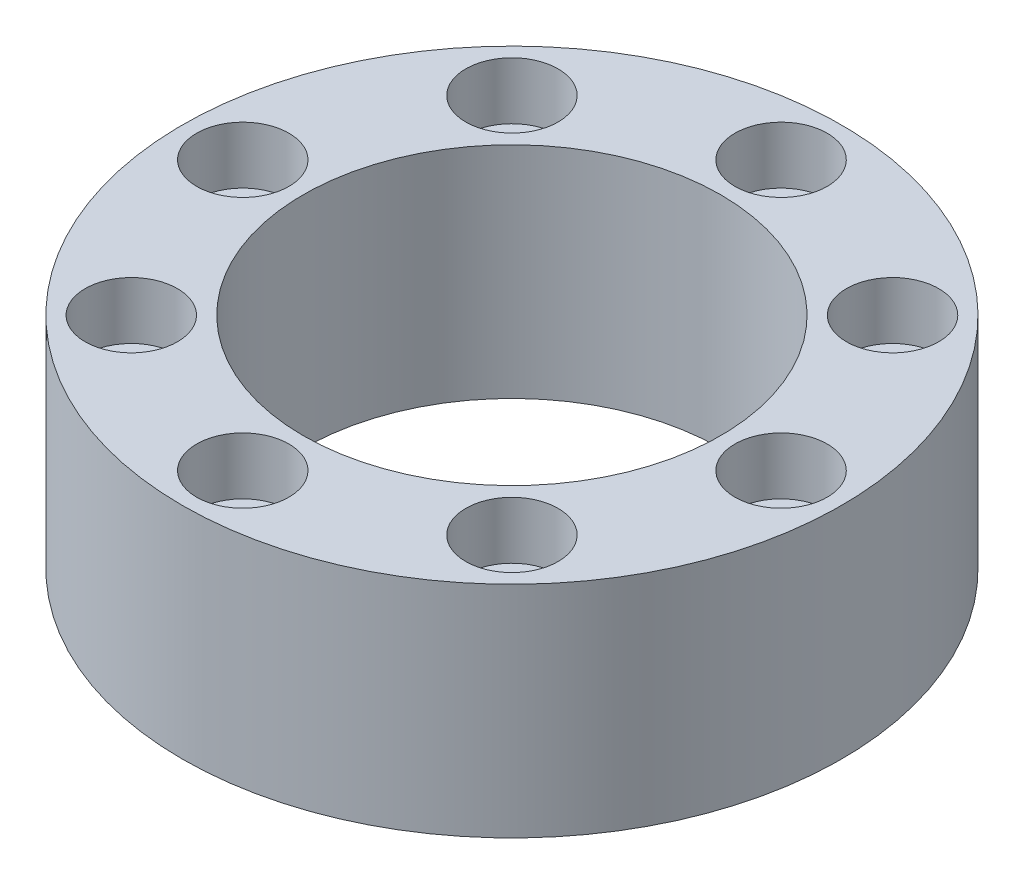
ISO-10303-21;
HEADER;
FILE_DESCRIPTION(('STEP AP214'),'2;1');
FILE_NAME('part.step','',(''),(''),'','','');
FILE_SCHEMA(('AUTOMOTIVE_DESIGN { 1 0 10303 214 1 1 1 1 }'));
ENDSEC;
DATA;
#1=APPLICATION_CONTEXT('core data for automotive mechanical design processes');
#2=APPLICATION_PROTOCOL_DEFINITION('international standard','automotive_design',2000,#1);
#3=PRODUCT_CONTEXT('',#1,'mechanical');
#4=PRODUCT('Part','Part','',(#3));
#5=PRODUCT_RELATED_PRODUCT_CATEGORY('part','',(#4));
#6=PRODUCT_DEFINITION_FORMATION('','',#4);
#7=PRODUCT_DEFINITION_CONTEXT('part definition',#1,'design');
#8=PRODUCT_DEFINITION('design','',#6,#7);
#9=PRODUCT_DEFINITION_SHAPE('','',#8);
#10=(LENGTH_UNIT() NAMED_UNIT(*) SI_UNIT(.MILLI.,.METRE.));
#11=(NAMED_UNIT(*) PLANE_ANGLE_UNIT() SI_UNIT($,.RADIAN.));
#12=(NAMED_UNIT(*) SI_UNIT($,.STERADIAN.) SOLID_ANGLE_UNIT());
#13=UNCERTAINTY_MEASURE_WITH_UNIT(LENGTH_MEASURE(1.E-05),#10,'distance_accuracy_value','');
#14=(GEOMETRIC_REPRESENTATION_CONTEXT(3) GLOBAL_UNCERTAINTY_ASSIGNED_CONTEXT((#13)) GLOBAL_UNIT_ASSIGNED_CONTEXT((#10,
#11,#12)) REPRESENTATION_CONTEXT('',''));
#15=CARTESIAN_POINT('',(0.,0.,0.));
#16=DIRECTION('',(0.,0.,1.));
#17=DIRECTION('',(1.,0.,0.));
#18=AXIS2_PLACEMENT_3D('',#15,#16,#17);
#19=CARTESIAN_POINT('',(17.3241161390704,0.,-17.3241161390704));
#20=DIRECTION('',(0.,1.,0.));
#21=DIRECTION('',(0.,0.,1.));
#22=AXIS2_PLACEMENT_3D('',#19,#20,#21);
#23=CYLINDRICAL_SURFACE('',#22,2.55);
#24=CARTESIAN_POINT('',(17.3241161390704,0.,-17.3241161390704));
#25=DIRECTION('',(0.,1.,0.));
#26=DIRECTION('',(0.,0.,1.));
#27=AXIS2_PLACEMENT_3D('',#24,#25,#26);
#28=CIRCLE('',#27,2.55);
#29=CARTESIAN_POINT('',(17.3241161390704,0.,-14.7741161390704));
#30=VERTEX_POINT('',#29);
#31=EDGE_CURVE('E215',#30,#30,#28,.T.);
#32=ORIENTED_EDGE('',*,*,#31,.F.);
#33=EDGE_LOOP('',(#32));
#34=FACE_BOUND('',#33,.T.);
#35=CARTESIAN_POINT('',(17.3241161390704,14.8,-17.3241161390704));
#36=DIRECTION('',(0.,1.,0.));
#37=DIRECTION('',(0.,0.,1.));
#38=AXIS2_PLACEMENT_3D('',#35,#36,#37);
#39=CIRCLE('',#38,2.55);
#40=CARTESIAN_POINT('',(17.3241161390704,14.8,-14.7741161390704));
#41=VERTEX_POINT('',#40);
#42=EDGE_CURVE('E47',#41,#41,#39,.F.);
#43=ORIENTED_EDGE('',*,*,#42,.F.);
#44=EDGE_LOOP('',(#43));
#45=FACE_BOUND('',#44,.T.);
#46=ADVANCED_FACE('F43',(#34,#45),#23,.F.);
#47=CARTESIAN_POINT('',(0.,0.,-24.5));
#48=DIRECTION('',(0.,1.,0.));
#49=DIRECTION('',(0.,0.,1.));
#50=AXIS2_PLACEMENT_3D('',#47,#48,#49);
#51=CYLINDRICAL_SURFACE('',#50,2.55);
#52=CARTESIAN_POINT('',(0.,0.,-24.5));
#53=DIRECTION('',(0.,1.,0.));
#54=DIRECTION('',(0.,0.,1.));
#55=AXIS2_PLACEMENT_3D('',#52,#53,#54);
#56=CIRCLE('',#55,2.55);
#57=CARTESIAN_POINT('',(0.,0.,-21.95));
#58=VERTEX_POINT('',#57);
#59=EDGE_CURVE('E225',#58,#58,#56,.T.);
#60=ORIENTED_EDGE('',*,*,#59,.F.);
#61=EDGE_LOOP('',(#60));
#62=FACE_BOUND('',#61,.T.);
#63=CARTESIAN_POINT('',(0.,14.8,-24.5));
#64=DIRECTION('',(0.,1.,0.));
#65=DIRECTION('',(0.,0.,1.));
#66=AXIS2_PLACEMENT_3D('',#63,#64,#65);
#67=CIRCLE('',#66,2.55);
#68=CARTESIAN_POINT('',(0.,14.8,-21.95));
#69=VERTEX_POINT('',#68);
#70=EDGE_CURVE('E387',#69,#69,#67,.F.);
#71=ORIENTED_EDGE('',*,*,#70,.F.);
#72=EDGE_LOOP('',(#71));
#73=FACE_BOUND('',#72,.T.);
#74=ADVANCED_FACE('F286',(#62,#73),#51,.F.);
#75=CARTESIAN_POINT('',(-17.3241161390704,0.,-17.3241161390704));
#76=DIRECTION('',(0.,1.,0.));
#77=DIRECTION('',(0.,0.,1.));
#78=AXIS2_PLACEMENT_3D('',#75,#76,#77);
#79=CYLINDRICAL_SURFACE('',#78,2.55);
#80=CARTESIAN_POINT('',(-17.3241161390704,0.,-17.3241161390704));
#81=DIRECTION('',(0.,1.,0.));
#82=DIRECTION('',(0.,0.,1.));
#83=AXIS2_PLACEMENT_3D('',#80,#81,#82);
#84=CIRCLE('',#83,2.55);
#85=CARTESIAN_POINT('',(-17.3241161390704,0.,-14.7741161390704));
#86=VERTEX_POINT('',#85);
#87=EDGE_CURVE('E230',#86,#86,#84,.T.);
#88=ORIENTED_EDGE('',*,*,#87,.F.);
#89=EDGE_LOOP('',(#88));
#90=FACE_BOUND('',#89,.T.);
#91=CARTESIAN_POINT('',(-17.3241161390704,14.8,-17.3241161390704));
#92=DIRECTION('',(0.,1.,0.));
#93=DIRECTION('',(0.,0.,1.));
#94=AXIS2_PLACEMENT_3D('',#91,#92,#93);
#95=CIRCLE('',#94,2.55);
#96=CARTESIAN_POINT('',(-17.3241161390704,14.8,-14.7741161390704));
#97=VERTEX_POINT('',#96);
#98=EDGE_CURVE('E393',#97,#97,#95,.F.);
#99=ORIENTED_EDGE('',*,*,#98,.F.);
#100=EDGE_LOOP('',(#99));
#101=FACE_BOUND('',#100,.T.);
#102=ADVANCED_FACE('F291',(#90,#101),#79,.F.);
#103=CARTESIAN_POINT('',(-24.5,0.,0.));
#104=DIRECTION('',(0.,1.,0.));
#105=DIRECTION('',(0.,0.,1.));
#106=AXIS2_PLACEMENT_3D('',#103,#104,#105);
#107=CYLINDRICAL_SURFACE('',#106,2.55);
#108=CARTESIAN_POINT('',(-24.5,0.,0.));
#109=DIRECTION('',(0.,1.,0.));
#110=DIRECTION('',(0.,0.,1.));
#111=AXIS2_PLACEMENT_3D('',#108,#109,#110);
#112=CIRCLE('',#111,2.55);
#113=CARTESIAN_POINT('',(-24.5,0.,2.55));
#114=VERTEX_POINT('',#113);
#115=EDGE_CURVE('E235',#114,#114,#112,.T.);
#116=ORIENTED_EDGE('',*,*,#115,.F.);
#117=EDGE_LOOP('',(#116));
#118=FACE_BOUND('',#117,.T.);
#119=CARTESIAN_POINT('',(-24.5,14.8,0.));
#120=DIRECTION('',(0.,1.,0.));
#121=DIRECTION('',(0.,0.,1.));
#122=AXIS2_PLACEMENT_3D('',#119,#120,#121);
#123=CIRCLE('',#122,2.55);
#124=CARTESIAN_POINT('',(-24.5,14.8,2.55));
#125=VERTEX_POINT('',#124);
#126=EDGE_CURVE('E399',#125,#125,#123,.F.);
#127=ORIENTED_EDGE('',*,*,#126,.F.);
#128=EDGE_LOOP('',(#127));
#129=FACE_BOUND('',#128,.T.);
#130=ADVANCED_FACE('F299',(#118,#129),#107,.F.);
#131=CARTESIAN_POINT('',(-17.3241161390704,0.,17.3241161390704));
#132=DIRECTION('',(0.,1.,0.));
#133=DIRECTION('',(0.,0.,1.));
#134=AXIS2_PLACEMENT_3D('',#131,#132,#133);
#135=CYLINDRICAL_SURFACE('',#134,2.55);
#136=CARTESIAN_POINT('',(-17.3241161390704,0.,17.3241161390704));
#137=DIRECTION('',(0.,1.,0.));
#138=DIRECTION('',(0.,0.,1.));
#139=AXIS2_PLACEMENT_3D('',#136,#137,#138);
#140=CIRCLE('',#139,2.55);
#141=CARTESIAN_POINT('',(-17.3241161390704,0.,19.8741161390704));
#142=VERTEX_POINT('',#141);
#143=EDGE_CURVE('E240',#142,#142,#140,.T.);
#144=ORIENTED_EDGE('',*,*,#143,.F.);
#145=EDGE_LOOP('',(#144));
#146=FACE_BOUND('',#145,.T.);
#147=CARTESIAN_POINT('',(-17.3241161390704,14.8,17.3241161390704));
#148=DIRECTION('',(0.,1.,0.));
#149=DIRECTION('',(0.,0.,1.));
#150=AXIS2_PLACEMENT_3D('',#147,#148,#149);
#151=CIRCLE('',#150,2.55);
#152=CARTESIAN_POINT('',(-17.3241161390704,14.8,19.8741161390704));
#153=VERTEX_POINT('',#152);
#154=EDGE_CURVE('E405',#153,#153,#151,.F.);
#155=ORIENTED_EDGE('',*,*,#154,.F.);
#156=EDGE_LOOP('',(#155));
#157=FACE_BOUND('',#156,.T.);
#158=ADVANCED_FACE('F303',(#146,#157),#135,.F.);
#159=CARTESIAN_POINT('',(0.,0.,24.5));
#160=DIRECTION('',(0.,1.,0.));
#161=DIRECTION('',(0.,0.,1.));
#162=AXIS2_PLACEMENT_3D('',#159,#160,#161);
#163=CYLINDRICAL_SURFACE('',#162,2.55);
#164=CARTESIAN_POINT('',(0.,0.,24.5));
#165=DIRECTION('',(0.,1.,0.));
#166=DIRECTION('',(0.,0.,1.));
#167=AXIS2_PLACEMENT_3D('',#164,#165,#166);
#168=CIRCLE('',#167,2.55);
#169=CARTESIAN_POINT('',(0.,0.,27.05));
#170=VERTEX_POINT('',#169);
#171=EDGE_CURVE('E245',#170,#170,#168,.T.);
#172=ORIENTED_EDGE('',*,*,#171,.F.);
#173=EDGE_LOOP('',(#172));
#174=FACE_BOUND('',#173,.T.);
#175=CARTESIAN_POINT('',(0.,14.8,24.5));
#176=DIRECTION('',(0.,1.,0.));
#177=DIRECTION('',(0.,0.,1.));
#178=AXIS2_PLACEMENT_3D('',#175,#176,#177);
#179=CIRCLE('',#178,2.55);
#180=CARTESIAN_POINT('',(0.,14.8,27.05));
#181=VERTEX_POINT('',#180);
#182=EDGE_CURVE('E409',#181,#181,#179,.F.);
#183=ORIENTED_EDGE('',*,*,#182,.F.);
#184=EDGE_LOOP('',(#183));
#185=FACE_BOUND('',#184,.T.);
#186=ADVANCED_FACE('F307',(#174,#185),#163,.F.);
#187=CARTESIAN_POINT('',(17.3241161390704,0.,17.3241161390704));
#188=DIRECTION('',(0.,1.,0.));
#189=DIRECTION('',(0.,0.,1.));
#190=AXIS2_PLACEMENT_3D('',#187,#188,#189);
#191=CYLINDRICAL_SURFACE('',#190,2.55);
#192=CARTESIAN_POINT('',(17.3241161390704,0.,17.3241161390704));
#193=DIRECTION('',(0.,1.,0.));
#194=DIRECTION('',(0.,0.,1.));
#195=AXIS2_PLACEMENT_3D('',#192,#193,#194);
#196=CIRCLE('',#195,2.55);
#197=CARTESIAN_POINT('',(17.3241161390704,0.,19.8741161390704));
#198=VERTEX_POINT('',#197);
#199=EDGE_CURVE('E249',#198,#198,#196,.T.);
#200=ORIENTED_EDGE('',*,*,#199,.F.);
#201=EDGE_LOOP('',(#200));
#202=FACE_BOUND('',#201,.T.);
#203=CARTESIAN_POINT('',(17.3241161390704,14.8,17.3241161390704));
#204=DIRECTION('',(0.,1.,0.));
#205=DIRECTION('',(0.,0.,1.));
#206=AXIS2_PLACEMENT_3D('',#203,#204,#205);
#207=CIRCLE('',#206,2.55);
#208=CARTESIAN_POINT('',(17.3241161390704,14.8,19.8741161390704));
#209=VERTEX_POINT('',#208);
#210=EDGE_CURVE('E413',#209,#209,#207,.F.);
#211=ORIENTED_EDGE('',*,*,#210,.F.);
#212=EDGE_LOOP('',(#211));
#213=FACE_BOUND('',#212,.T.);
#214=ADVANCED_FACE('F311',(#202,#213),#191,.F.);
#215=CARTESIAN_POINT('',(24.5,0.,0.));
#216=DIRECTION('',(0.,1.,0.));
#217=DIRECTION('',(0.,0.,1.));
#218=AXIS2_PLACEMENT_3D('',#215,#216,#217);
#219=CYLINDRICAL_SURFACE('',#218,2.55);
#220=CARTESIAN_POINT('',(24.5,0.,0.));
#221=DIRECTION('',(0.,1.,0.));
#222=DIRECTION('',(0.,0.,1.));
#223=AXIS2_PLACEMENT_3D('',#220,#221,#222);
#224=CIRCLE('',#223,2.55);
#225=CARTESIAN_POINT('',(24.5,0.,2.55));
#226=VERTEX_POINT('',#225);
#227=EDGE_CURVE('E84',#226,#226,#224,.T.);
#228=ORIENTED_EDGE('',*,*,#227,.F.);
#229=EDGE_LOOP('',(#228));
#230=FACE_BOUND('',#229,.T.);
#231=CARTESIAN_POINT('',(24.5,14.8,0.));
#232=DIRECTION('',(0.,1.,0.));
#233=DIRECTION('',(0.,0.,1.));
#234=AXIS2_PLACEMENT_3D('',#231,#232,#233);
#235=CIRCLE('',#234,2.55);
#236=CARTESIAN_POINT('',(24.5,14.8,2.55));
#237=VERTEX_POINT('',#236);
#238=EDGE_CURVE('E416',#237,#237,#235,.F.);
#239=ORIENTED_EDGE('',*,*,#238,.F.);
#240=EDGE_LOOP('',(#239));
#241=FACE_BOUND('',#240,.T.);
#242=ADVANCED_FACE('F315',(#230,#241),#219,.F.);
#243=CARTESIAN_POINT('',(0.,20.,0.));
#244=DIRECTION('',(0.,1.,0.));
#245=DIRECTION('',(0.,0.,1.));
#246=AXIS2_PLACEMENT_3D('',#243,#244,#245);
#247=PLANE('',#246);
#248=CARTESIAN_POINT('',(17.3241161390704,20.,17.3241161390704));
#249=DIRECTION('',(0.,1.,0.));
#250=DIRECTION('',(0.,0.,1.));
#251=AXIS2_PLACEMENT_3D('',#248,#249,#250);
#252=CIRCLE('',#251,4.2);
#253=CARTESIAN_POINT('',(17.3241161390704,20.,21.5241161390704));
#254=VERTEX_POINT('',#253);
#255=EDGE_CURVE('E100',#254,#254,#252,.T.);
#256=ORIENTED_EDGE('',*,*,#255,.F.);
#257=EDGE_LOOP('',(#256));
#258=FACE_BOUND('',#257,.T.);
#259=CARTESIAN_POINT('',(0.,20.,24.5));
#260=DIRECTION('',(0.,1.,0.));
#261=DIRECTION('',(0.,0.,1.));
#262=AXIS2_PLACEMENT_3D('',#259,#260,#261);
#263=CIRCLE('',#262,4.2);
#264=CARTESIAN_POINT('',(0.,20.,28.7));
#265=VERTEX_POINT('',#264);
#266=EDGE_CURVE('E139',#265,#265,#263,.T.);
#267=ORIENTED_EDGE('',*,*,#266,.F.);
#268=EDGE_LOOP('',(#267));
#269=FACE_BOUND('',#268,.T.);
#270=CARTESIAN_POINT('',(-17.3241161390704,20.,17.3241161390704));
#271=DIRECTION('',(0.,1.,0.));
#272=DIRECTION('',(0.,0.,1.));
#273=AXIS2_PLACEMENT_3D('',#270,#271,#272);
#274=CIRCLE('',#273,4.2);
#275=CARTESIAN_POINT('',(-17.3241161390704,20.,21.5241161390704));
#276=VERTEX_POINT('',#275);
#277=EDGE_CURVE('E173',#276,#276,#274,.T.);
#278=ORIENTED_EDGE('',*,*,#277,.F.);
#279=EDGE_LOOP('',(#278));
#280=FACE_BOUND('',#279,.T.);
#281=CARTESIAN_POINT('',(-24.5,20.,0.));
#282=DIRECTION('',(0.,1.,0.));
#283=DIRECTION('',(0.,0.,1.));
#284=AXIS2_PLACEMENT_3D('',#281,#282,#283);
#285=CIRCLE('',#284,4.2);
#286=CARTESIAN_POINT('',(-24.5,20.,4.2));
#287=VERTEX_POINT('',#286);
#288=EDGE_CURVE('E201',#287,#287,#285,.T.);
#289=ORIENTED_EDGE('',*,*,#288,.F.);
#290=EDGE_LOOP('',(#289));
#291=FACE_BOUND('',#290,.T.);
#292=CARTESIAN_POINT('',(-17.3241161390702,20.,-17.3241161390707));
#293=DIRECTION('',(0.,1.,0.));
#294=DIRECTION('',(0.,0.,1.));
#295=AXIS2_PLACEMENT_3D('',#292,#293,#294);
#296=CIRCLE('',#295,4.2);
#297=CARTESIAN_POINT('',(-17.3241161390702,20.,-13.1241161390707));
#298=VERTEX_POINT('',#297);
#299=EDGE_CURVE('E188',#298,#298,#296,.T.);
#300=ORIENTED_EDGE('',*,*,#299,.F.);
#301=EDGE_LOOP('',(#300));
#302=FACE_BOUND('',#301,.T.);
#303=CARTESIAN_POINT('',(3.52582546492286E-13,20.,-24.5));
#304=DIRECTION('',(0.,1.,0.));
#305=DIRECTION('',(0.,0.,1.));
#306=AXIS2_PLACEMENT_3D('',#303,#304,#305);
#307=CIRCLE('',#306,4.2);
#308=CARTESIAN_POINT('',(3.52582546492286E-13,20.,-20.3));
#309=VERTEX_POINT('',#308);
#310=EDGE_CURVE('E156',#309,#309,#307,.T.);
#311=ORIENTED_EDGE('',*,*,#310,.F.);
#312=EDGE_LOOP('',(#311));
#313=FACE_BOUND('',#312,.T.);
#314=CARTESIAN_POINT('',(17.3241161390707,20.,-17.3241161390702));
#315=DIRECTION('',(0.,1.,0.));
#316=DIRECTION('',(0.,0.,1.));
#317=AXIS2_PLACEMENT_3D('',#314,#315,#316);
#318=CIRCLE('',#317,4.2);
#319=CARTESIAN_POINT('',(17.3241161390707,20.,-13.1241161390702));
#320=VERTEX_POINT('',#319);
#321=EDGE_CURVE('E120',#320,#320,#318,.T.);
#322=ORIENTED_EDGE('',*,*,#321,.F.);
#323=EDGE_LOOP('',(#322));
#324=FACE_BOUND('',#323,.T.);
#325=CARTESIAN_POINT('',(24.5,20.,0.));
#326=DIRECTION('',(0.,1.,0.));
#327=DIRECTION('',(0.,0.,1.));
#328=AXIS2_PLACEMENT_3D('',#325,#326,#327);
#329=CIRCLE('',#328,4.2);
#330=CARTESIAN_POINT('',(24.5,20.,4.2));
#331=VERTEX_POINT('',#330);
#332=EDGE_CURVE('E75',#331,#331,#329,.T.);
#333=ORIENTED_EDGE('',*,*,#332,.F.);
#334=EDGE_LOOP('',(#333));
#335=FACE_BOUND('',#334,.T.);
#336=CARTESIAN_POINT('',(0.,20.,0.));
#337=DIRECTION('',(0.,1.,0.));
#338=DIRECTION('',(0.,0.,1.));
#339=AXIS2_PLACEMENT_3D('',#336,#337,#338);
#340=CIRCLE('',#339,30.);
#341=CARTESIAN_POINT('',(0.,20.,30.));
#342=VERTEX_POINT('',#341);
#343=EDGE_CURVE('E11',#342,#342,#340,.T.);
#344=ORIENTED_EDGE('',*,*,#343,.T.);
#345=EDGE_LOOP('',(#344));
#346=FACE_BOUND('',#345,.T.);
#347=CARTESIAN_POINT('',(0.,20.,0.));
#348=DIRECTION('',(0.,1.,0.));
#349=DIRECTION('',(0.,0.,1.));
#350=AXIS2_PLACEMENT_3D('',#347,#348,#349);
#351=CIRCLE('',#350,19.);
#352=CARTESIAN_POINT('',(0.,20.,19.));
#353=VERTEX_POINT('',#352);
#354=EDGE_CURVE('E60',#353,#353,#351,.T.);
#355=ORIENTED_EDGE('',*,*,#354,.F.);
#356=EDGE_LOOP('',(#355));
#357=FACE_BOUND('',#356,.T.);
#358=ADVANCED_FACE('F319',(#258,#269,#280,#291,#302,#313,#324,#335,#346,#357),#247,.T.);
#359=CARTESIAN_POINT('',(0.,0.,0.));
#360=DIRECTION('',(0.,1.,0.));
#361=DIRECTION('',(0.,0.,1.));
#362=AXIS2_PLACEMENT_3D('',#359,#360,#361);
#363=PLANE('',#362);
#364=ORIENTED_EDGE('',*,*,#227,.T.);
#365=EDGE_LOOP('',(#364));
#366=FACE_BOUND('',#365,.T.);
#367=ORIENTED_EDGE('',*,*,#199,.T.);
#368=EDGE_LOOP('',(#367));
#369=FACE_BOUND('',#368,.T.);
#370=ORIENTED_EDGE('',*,*,#171,.T.);
#371=EDGE_LOOP('',(#370));
#372=FACE_BOUND('',#371,.T.);
#373=ORIENTED_EDGE('',*,*,#143,.T.);
#374=EDGE_LOOP('',(#373));
#375=FACE_BOUND('',#374,.T.);
#376=ORIENTED_EDGE('',*,*,#115,.T.);
#377=EDGE_LOOP('',(#376));
#378=FACE_BOUND('',#377,.T.);
#379=ORIENTED_EDGE('',*,*,#87,.T.);
#380=EDGE_LOOP('',(#379));
#381=FACE_BOUND('',#380,.T.);
#382=ORIENTED_EDGE('',*,*,#59,.T.);
#383=EDGE_LOOP('',(#382));
#384=FACE_BOUND('',#383,.T.);
#385=ORIENTED_EDGE('',*,*,#31,.T.);
#386=EDGE_LOOP('',(#385));
#387=FACE_BOUND('',#386,.T.);
#388=CARTESIAN_POINT('',(0.,0.,0.));
#389=DIRECTION('',(0.,1.,0.));
#390=DIRECTION('',(0.,0.,1.));
#391=AXIS2_PLACEMENT_3D('',#388,#389,#390);
#392=CIRCLE('',#391,30.);
#393=CARTESIAN_POINT('',(0.,0.,30.));
#394=VERTEX_POINT('',#393);
#395=EDGE_CURVE('E52',#394,#394,#392,.T.);
#396=ORIENTED_EDGE('',*,*,#395,.F.);
#397=EDGE_LOOP('',(#396));
#398=FACE_BOUND('',#397,.T.);
#399=CARTESIAN_POINT('',(0.,0.,0.));
#400=DIRECTION('',(0.,1.,0.));
#401=DIRECTION('',(0.,0.,1.));
#402=AXIS2_PLACEMENT_3D('',#399,#400,#401);
#403=CIRCLE('',#402,19.);
#404=CARTESIAN_POINT('',(0.,0.,19.));
#405=VERTEX_POINT('',#404);
#406=EDGE_CURVE('E64',#405,#405,#403,.T.);
#407=ORIENTED_EDGE('',*,*,#406,.T.);
#408=EDGE_LOOP('',(#407));
#409=FACE_BOUND('',#408,.T.);
#410=ADVANCED_FACE('F268',(#366,#369,#372,#375,#378,#381,#384,#387,#398,#409),#363,.F.);
#411=CARTESIAN_POINT('',(0.,20.,0.));
#412=DIRECTION('',(0.,-1.,0.));
#413=DIRECTION('',(0.,0.,-1.));
#414=AXIS2_PLACEMENT_3D('',#411,#412,#413);
#415=CYLINDRICAL_SURFACE('',#414,30.);
#416=ORIENTED_EDGE('',*,*,#343,.F.);
#417=EDGE_LOOP('',(#416));
#418=FACE_BOUND('',#417,.T.);
#419=ORIENTED_EDGE('',*,*,#395,.T.);
#420=EDGE_LOOP('',(#419));
#421=FACE_BOUND('',#420,.T.);
#422=ADVANCED_FACE('F45',(#418,#421),#415,.T.);
#423=CARTESIAN_POINT('',(0.,20.,0.));
#424=DIRECTION('',(0.,-1.,0.));
#425=DIRECTION('',(0.,0.,-1.));
#426=AXIS2_PLACEMENT_3D('',#423,#424,#425);
#427=CYLINDRICAL_SURFACE('',#426,19.);
#428=ORIENTED_EDGE('',*,*,#354,.T.);
#429=EDGE_LOOP('',(#428));
#430=FACE_BOUND('',#429,.T.);
#431=ORIENTED_EDGE('',*,*,#406,.F.);
#432=EDGE_LOOP('',(#431));
#433=FACE_BOUND('',#432,.T.);
#434=ADVANCED_FACE('F270',(#430,#433),#427,.F.);
#435=CARTESIAN_POINT('',(24.5,14.8,0.));
#436=DIRECTION('',(0.,1.,0.));
#437=DIRECTION('',(0.,0.,1.));
#438=AXIS2_PLACEMENT_3D('',#435,#436,#437);
#439=PLANE('',#438);
#440=CARTESIAN_POINT('',(24.5,14.8,0.));
#441=DIRECTION('',(0.,1.,0.));
#442=DIRECTION('',(0.,0.,1.));
#443=AXIS2_PLACEMENT_3D('',#440,#441,#442);
#444=CIRCLE('',#443,4.2);
#445=CARTESIAN_POINT('',(24.5,14.8,4.2));
#446=VERTEX_POINT('',#445);
#447=EDGE_CURVE('E81',#446,#446,#444,.T.);
#448=ORIENTED_EDGE('',*,*,#447,.T.);
#449=EDGE_LOOP('',(#448));
#450=FACE_BOUND('',#449,.T.);
#451=ORIENTED_EDGE('',*,*,#238,.T.);
#452=EDGE_LOOP('',(#451));
#453=FACE_BOUND('',#452,.T.);
#454=ADVANCED_FACE('F272',(#450,#453),#439,.T.);
#455=CARTESIAN_POINT('',(24.5,14.8,0.));
#456=DIRECTION('',(0.,1.,0.));
#457=DIRECTION('',(0.,0.,1.));
#458=AXIS2_PLACEMENT_3D('',#455,#456,#457);
#459=CYLINDRICAL_SURFACE('',#458,4.2);
#460=ORIENTED_EDGE('',*,*,#447,.F.);
#461=EDGE_LOOP('',(#460));
#462=FACE_BOUND('',#461,.T.);
#463=ORIENTED_EDGE('',*,*,#332,.T.);
#464=EDGE_LOOP('',(#463));
#465=FACE_BOUND('',#464,.T.);
#466=ADVANCED_FACE('F279',(#462,#465),#459,.F.);
#467=CARTESIAN_POINT('',(17.3241161390704,14.8,17.3241161390704));
#468=DIRECTION('',(0.,1.,0.));
#469=DIRECTION('',(0.,0.,1.));
#470=AXIS2_PLACEMENT_3D('',#467,#468,#469);
#471=PLANE('',#470);
#472=CARTESIAN_POINT('',(17.3241161390704,14.8,17.3241161390704));
#473=DIRECTION('',(0.,1.,0.));
#474=DIRECTION('',(0.,0.,1.));
#475=AXIS2_PLACEMENT_3D('',#472,#473,#474);
#476=CIRCLE('',#475,4.2);
#477=CARTESIAN_POINT('',(17.3241161390704,14.8,21.5241161390704));
#478=VERTEX_POINT('',#477);
#479=EDGE_CURVE('E105',#478,#478,#476,.T.);
#480=ORIENTED_EDGE('',*,*,#479,.T.);
#481=EDGE_LOOP('',(#480));
#482=FACE_BOUND('',#481,.T.);
#483=ORIENTED_EDGE('',*,*,#210,.T.);
#484=EDGE_LOOP('',(#483));
#485=FACE_BOUND('',#484,.T.);
#486=ADVANCED_FACE('F322',(#482,#485),#471,.T.);
#487=CARTESIAN_POINT('',(17.3241161390704,14.8,17.3241161390704));
#488=DIRECTION('',(0.,1.,0.));
#489=DIRECTION('',(0.,0.,1.));
#490=AXIS2_PLACEMENT_3D('',#487,#488,#489);
#491=CYLINDRICAL_SURFACE('',#490,4.2);
#492=ORIENTED_EDGE('',*,*,#479,.F.);
#493=EDGE_LOOP('',(#492));
#494=FACE_BOUND('',#493,.T.);
#495=ORIENTED_EDGE('',*,*,#255,.T.);
#496=EDGE_LOOP('',(#495));
#497=FACE_BOUND('',#496,.T.);
#498=ADVANCED_FACE('F325',(#494,#497),#491,.F.);
#499=CARTESIAN_POINT('',(0.,14.8,24.5));
#500=DIRECTION('',(0.,1.,0.));
#501=DIRECTION('',(0.,0.,1.));
#502=AXIS2_PLACEMENT_3D('',#499,#500,#501);
#503=PLANE('',#502);
#504=CARTESIAN_POINT('',(0.,14.8,24.5));
#505=DIRECTION('',(0.,1.,0.));
#506=DIRECTION('',(0.,0.,1.));
#507=AXIS2_PLACEMENT_3D('',#504,#505,#506);
#508=CIRCLE('',#507,4.2);
#509=CARTESIAN_POINT('',(0.,14.8,28.7));
#510=VERTEX_POINT('',#509);
#511=EDGE_CURVE('E144',#510,#510,#508,.T.);
#512=ORIENTED_EDGE('',*,*,#511,.T.);
#513=EDGE_LOOP('',(#512));
#514=FACE_BOUND('',#513,.T.);
#515=ORIENTED_EDGE('',*,*,#182,.T.);
#516=EDGE_LOOP('',(#515));
#517=FACE_BOUND('',#516,.T.);
#518=ADVANCED_FACE('F328',(#514,#517),#503,.T.);
#519=CARTESIAN_POINT('',(0.,14.8,24.5));
#520=DIRECTION('',(0.,1.,0.));
#521=DIRECTION('',(0.,0.,1.));
#522=AXIS2_PLACEMENT_3D('',#519,#520,#521);
#523=CYLINDRICAL_SURFACE('',#522,4.2);
#524=ORIENTED_EDGE('',*,*,#511,.F.);
#525=EDGE_LOOP('',(#524));
#526=FACE_BOUND('',#525,.T.);
#527=ORIENTED_EDGE('',*,*,#266,.T.);
#528=EDGE_LOOP('',(#527));
#529=FACE_BOUND('',#528,.T.);
#530=ADVANCED_FACE('F333',(#526,#529),#523,.F.);
#531=CARTESIAN_POINT('',(-17.3241161390704,14.8,17.3241161390704));
#532=DIRECTION('',(0.,1.,0.));
#533=DIRECTION('',(0.,0.,1.));
#534=AXIS2_PLACEMENT_3D('',#531,#532,#533);
#535=PLANE('',#534);
#536=CARTESIAN_POINT('',(-17.3241161390704,14.8,17.3241161390704));
#537=DIRECTION('',(0.,1.,0.));
#538=DIRECTION('',(0.,0.,1.));
#539=AXIS2_PLACEMENT_3D('',#536,#537,#538);
#540=CIRCLE('',#539,4.2);
#541=CARTESIAN_POINT('',(-17.3241161390704,14.8,21.5241161390704));
#542=VERTEX_POINT('',#541);
#543=EDGE_CURVE('E178',#542,#542,#540,.T.);
#544=ORIENTED_EDGE('',*,*,#543,.T.);
#545=EDGE_LOOP('',(#544));
#546=FACE_BOUND('',#545,.T.);
#547=ORIENTED_EDGE('',*,*,#154,.T.);
#548=EDGE_LOOP('',(#547));
#549=FACE_BOUND('',#548,.T.);
#550=ADVANCED_FACE('F336',(#546,#549),#535,.T.);
#551=CARTESIAN_POINT('',(-17.3241161390704,14.8,17.3241161390704));
#552=DIRECTION('',(0.,1.,0.));
#553=DIRECTION('',(0.,0.,1.));
#554=AXIS2_PLACEMENT_3D('',#551,#552,#553);
#555=CYLINDRICAL_SURFACE('',#554,4.2);
#556=ORIENTED_EDGE('',*,*,#543,.F.);
#557=EDGE_LOOP('',(#556));
#558=FACE_BOUND('',#557,.T.);
#559=ORIENTED_EDGE('',*,*,#277,.T.);
#560=EDGE_LOOP('',(#559));
#561=FACE_BOUND('',#560,.T.);
#562=ADVANCED_FACE('F341',(#558,#561),#555,.F.);
#563=CARTESIAN_POINT('',(-24.5,14.8,0.));
#564=DIRECTION('',(0.,1.,0.));
#565=DIRECTION('',(0.,0.,1.));
#566=AXIS2_PLACEMENT_3D('',#563,#564,#565);
#567=PLANE('',#566);
#568=CARTESIAN_POINT('',(-24.5,14.8,0.));
#569=DIRECTION('',(0.,1.,0.));
#570=DIRECTION('',(0.,0.,1.));
#571=AXIS2_PLACEMENT_3D('',#568,#569,#570);
#572=CIRCLE('',#571,4.2);
#573=CARTESIAN_POINT('',(-24.5,14.8,4.2));
#574=VERTEX_POINT('',#573);
#575=EDGE_CURVE('E193',#574,#574,#572,.T.);
#576=ORIENTED_EDGE('',*,*,#575,.T.);
#577=EDGE_LOOP('',(#576));
#578=FACE_BOUND('',#577,.T.);
#579=ORIENTED_EDGE('',*,*,#126,.T.);
#580=EDGE_LOOP('',(#579));
#581=FACE_BOUND('',#580,.T.);
#582=ADVANCED_FACE('F344',(#578,#581),#567,.T.);
#583=CARTESIAN_POINT('',(-24.5,14.8,0.));
#584=DIRECTION('',(0.,1.,0.));
#585=DIRECTION('',(0.,0.,1.));
#586=AXIS2_PLACEMENT_3D('',#583,#584,#585);
#587=CYLINDRICAL_SURFACE('',#586,4.2);
#588=ORIENTED_EDGE('',*,*,#575,.F.);
#589=EDGE_LOOP('',(#588));
#590=FACE_BOUND('',#589,.T.);
#591=ORIENTED_EDGE('',*,*,#288,.T.);
#592=EDGE_LOOP('',(#591));
#593=FACE_BOUND('',#592,.T.);
#594=ADVANCED_FACE('F349',(#590,#593),#587,.F.);
#595=CARTESIAN_POINT('',(-17.3241161390702,14.8,-17.3241161390707));
#596=DIRECTION('',(0.,1.,0.));
#597=DIRECTION('',(0.,0.,1.));
#598=AXIS2_PLACEMENT_3D('',#595,#596,#597);
#599=PLANE('',#598);
#600=CARTESIAN_POINT('',(-17.3241161390702,14.8,-17.3241161390707));
#601=DIRECTION('',(0.,1.,0.));
#602=DIRECTION('',(0.,0.,1.));
#603=AXIS2_PLACEMENT_3D('',#600,#601,#602);
#604=CIRCLE('',#603,4.2);
#605=CARTESIAN_POINT('',(-17.3241161390702,14.8,-13.1241161390707));
#606=VERTEX_POINT('',#605);
#607=EDGE_CURVE('E161',#606,#606,#604,.T.);
#608=ORIENTED_EDGE('',*,*,#607,.T.);
#609=EDGE_LOOP('',(#608));
#610=FACE_BOUND('',#609,.T.);
#611=ORIENTED_EDGE('',*,*,#98,.T.);
#612=EDGE_LOOP('',(#611));
#613=FACE_BOUND('',#612,.T.);
#614=ADVANCED_FACE('F352',(#610,#613),#599,.T.);
#615=CARTESIAN_POINT('',(-17.3241161390702,14.8,-17.3241161390707));
#616=DIRECTION('',(0.,1.,0.));
#617=DIRECTION('',(0.,0.,1.));
#618=AXIS2_PLACEMENT_3D('',#615,#616,#617);
#619=CYLINDRICAL_SURFACE('',#618,4.2);
#620=ORIENTED_EDGE('',*,*,#607,.F.);
#621=EDGE_LOOP('',(#620));
#622=FACE_BOUND('',#621,.T.);
#623=ORIENTED_EDGE('',*,*,#299,.T.);
#624=EDGE_LOOP('',(#623));
#625=FACE_BOUND('',#624,.T.);
#626=ADVANCED_FACE('F357',(#622,#625),#619,.F.);
#627=CARTESIAN_POINT('',(3.52582546492286E-13,14.8,-24.5));
#628=DIRECTION('',(0.,1.,0.));
#629=DIRECTION('',(0.,0.,1.));
#630=AXIS2_PLACEMENT_3D('',#627,#628,#629);
#631=PLANE('',#630);
#632=CARTESIAN_POINT('',(3.52582546492286E-13,14.8,-24.5));
#633=DIRECTION('',(0.,1.,0.));
#634=DIRECTION('',(0.,0.,1.));
#635=AXIS2_PLACEMENT_3D('',#632,#633,#634);
#636=CIRCLE('',#635,4.2);
#637=CARTESIAN_POINT('',(3.52582546492286E-13,14.8,-20.3));
#638=VERTEX_POINT('',#637);
#639=EDGE_CURVE('E126',#638,#638,#636,.T.);
#640=ORIENTED_EDGE('',*,*,#639,.T.);
#641=EDGE_LOOP('',(#640));
#642=FACE_BOUND('',#641,.T.);
#643=ORIENTED_EDGE('',*,*,#70,.T.);
#644=EDGE_LOOP('',(#643));
#645=FACE_BOUND('',#644,.T.);
#646=ADVANCED_FACE('F360',(#642,#645),#631,.T.);
#647=CARTESIAN_POINT('',(3.52582546492286E-13,14.8,-24.5));
#648=DIRECTION('',(0.,1.,0.));
#649=DIRECTION('',(0.,0.,1.));
#650=AXIS2_PLACEMENT_3D('',#647,#648,#649);
#651=CYLINDRICAL_SURFACE('',#650,4.2);
#652=ORIENTED_EDGE('',*,*,#639,.F.);
#653=EDGE_LOOP('',(#652));
#654=FACE_BOUND('',#653,.T.);
#655=ORIENTED_EDGE('',*,*,#310,.T.);
#656=EDGE_LOOP('',(#655));
#657=FACE_BOUND('',#656,.T.);
#658=ADVANCED_FACE('F365',(#654,#657),#651,.F.);
#659=CARTESIAN_POINT('',(17.3241161390707,14.8,-17.3241161390702));
#660=DIRECTION('',(0.,1.,0.));
#661=DIRECTION('',(0.,0.,1.));
#662=AXIS2_PLACEMENT_3D('',#659,#660,#661);
#663=PLANE('',#662);
#664=CARTESIAN_POINT('',(17.3241161390707,14.8,-17.3241161390702));
#665=DIRECTION('',(0.,1.,0.));
#666=DIRECTION('',(0.,0.,1.));
#667=AXIS2_PLACEMENT_3D('',#664,#665,#666);
#668=CIRCLE('',#667,4.2);
#669=CARTESIAN_POINT('',(17.3241161390707,14.8,-13.1241161390702));
#670=VERTEX_POINT('',#669);
#671=EDGE_CURVE('E82',#670,#670,#668,.T.);
#672=ORIENTED_EDGE('',*,*,#671,.T.);
#673=EDGE_LOOP('',(#672));
#674=FACE_BOUND('',#673,.T.);
#675=ORIENTED_EDGE('',*,*,#42,.T.);
#676=EDGE_LOOP('',(#675));
#677=FACE_BOUND('',#676,.T.);
#678=ADVANCED_FACE('F368',(#674,#677),#663,.T.);
#679=CARTESIAN_POINT('',(17.3241161390707,14.8,-17.3241161390702));
#680=DIRECTION('',(0.,1.,0.));
#681=DIRECTION('',(0.,0.,1.));
#682=AXIS2_PLACEMENT_3D('',#679,#680,#681);
#683=CYLINDRICAL_SURFACE('',#682,4.2);
#684=ORIENTED_EDGE('',*,*,#671,.F.);
#685=EDGE_LOOP('',(#684));
#686=FACE_BOUND('',#685,.T.);
#687=ORIENTED_EDGE('',*,*,#321,.T.);
#688=EDGE_LOOP('',(#687));
#689=FACE_BOUND('',#688,.T.);
#690=ADVANCED_FACE('F373',(#686,#689),#683,.F.);
#691=CLOSED_SHELL('',(#46,#74,#102,#130,#158,#186,#214,#242,#358,#410,#422,#434,#454,#466,#486,
#498,#518,#530,#550,#562,#582,#594,#614,#626,#646,#658,#678,#690));
#692=MANIFOLD_SOLID_BREP('B2',#691);
#693=ADVANCED_BREP_SHAPE_REPRESENTATION('',(#18,#692),#14);
#694=SHAPE_DEFINITION_REPRESENTATION(#9,#693);
ENDSEC;
END-ISO-10303-21;
